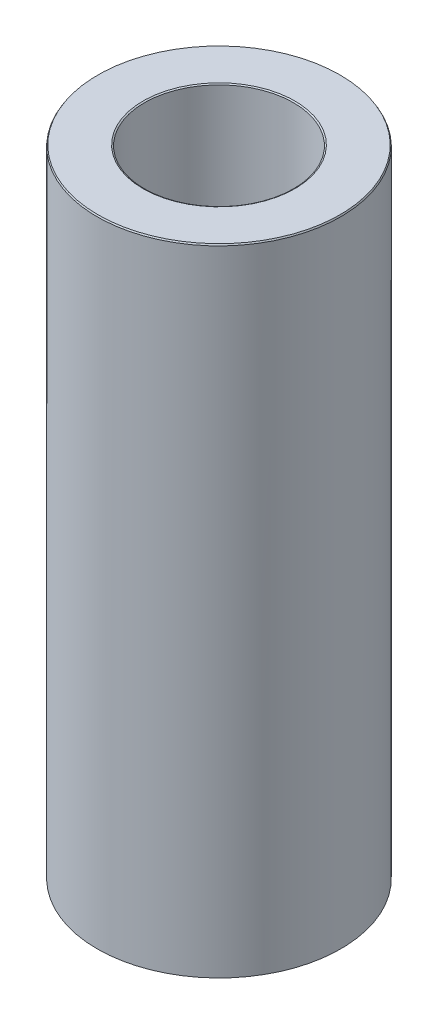
ISO-10303-21;
HEADER;
FILE_DESCRIPTION(('STEP AP214'),'2;1');
FILE_NAME('part.step','',(''),(''),'','','');
FILE_SCHEMA(('AUTOMOTIVE_DESIGN { 1 0 10303 214 1 1 1 1 }'));
ENDSEC;
DATA;
#1=APPLICATION_CONTEXT('core data for automotive mechanical design processes');
#2=APPLICATION_PROTOCOL_DEFINITION('international standard','automotive_design',2000,#1);
#3=PRODUCT_CONTEXT('',#1,'mechanical');
#4=PRODUCT('Part','Part','',(#3));
#5=PRODUCT_RELATED_PRODUCT_CATEGORY('part','',(#4));
#6=PRODUCT_DEFINITION_FORMATION('','',#4);
#7=PRODUCT_DEFINITION_CONTEXT('part definition',#1,'design');
#8=PRODUCT_DEFINITION('design','',#6,#7);
#9=PRODUCT_DEFINITION_SHAPE('','',#8);
#10=(LENGTH_UNIT() NAMED_UNIT(*) SI_UNIT(.MILLI.,.METRE.));
#11=(NAMED_UNIT(*) PLANE_ANGLE_UNIT() SI_UNIT($,.RADIAN.));
#12=(NAMED_UNIT(*) SI_UNIT($,.STERADIAN.) SOLID_ANGLE_UNIT());
#13=UNCERTAINTY_MEASURE_WITH_UNIT(LENGTH_MEASURE(1.E-05),#10,'distance_accuracy_value','');
#14=(GEOMETRIC_REPRESENTATION_CONTEXT(3) GLOBAL_UNCERTAINTY_ASSIGNED_CONTEXT((#13)) GLOBAL_UNIT_ASSIGNED_CONTEXT((#10,
#11,#12)) REPRESENTATION_CONTEXT('',''));
#15=CARTESIAN_POINT('',(0.,0.,0.));
#16=DIRECTION('',(0.,0.,1.));
#17=DIRECTION('',(1.,0.,0.));
#18=AXIS2_PLACEMENT_3D('',#15,#16,#17);
#19=CARTESIAN_POINT('',(0.,300.156189150975,0.));
#20=DIRECTION('',(0.,-1.,0.));
#21=DIRECTION('',(0.,0.,-1.));
#22=AXIS2_PLACEMENT_3D('',#19,#20,#21);
#23=CYLINDRICAL_SURFACE('',#22,57.5);
#24=CARTESIAN_POINT('',(0.,0.37526282528616,0.));
#25=DIRECTION('',(0.,1.,0.));
#26=DIRECTION('',(0.,0.,1.));
#27=AXIS2_PLACEMENT_3D('',#24,#25,#26);
#28=CIRCLE('',#27,57.5);
#29=CARTESIAN_POINT('',(0.,0.375262825286105,-57.5));
#30=VERTEX_POINT('',#29);
#31=EDGE_CURVE('E10',#30,#30,#28,.T.);
#32=CARTESIAN_POINT('',(0.,299.506214871388,0.));
#33=DIRECTION('',(0.,1.,0.));
#34=DIRECTION('',(0.,0.,1.));
#35=AXIS2_PLACEMENT_3D('',#32,#33,#34);
#36=CIRCLE('',#35,57.5);
#37=CARTESIAN_POINT('',(0.,299.506214871388,-57.5));
#38=VERTEX_POINT('',#37);
#39=EDGE_CURVE('E50',#38,#38,#36,.F.);
#40=CARTESIAN_POINT('',(0.,0.375262825286105,-57.5));
#41=CARTESIAN_POINT('',(0.,3.491210242433,-57.5));
#42=CARTESIAN_POINT('',(0.,6.6071576595799,-57.5));
#43=CARTESIAN_POINT('',(0.,12.8390524938737,-57.5));
#44=CARTESIAN_POINT('',(0.,15.9549999110206,-57.5));
#45=CARTESIAN_POINT('',(0.,22.1868947453144,-57.5));
#46=CARTESIAN_POINT('',(0.,25.3028421624613,-57.5));
#47=CARTESIAN_POINT('',(0.,31.5347369967551,-57.5));
#48=CARTESIAN_POINT('',(0.,34.650684413902,-57.5));
#49=CARTESIAN_POINT('',(0.,40.8825792481958,-57.5));
#50=CARTESIAN_POINT('',(0.,43.9985266653427,-57.5));
#51=CARTESIAN_POINT('',(0.,50.2304214996365,-57.5));
#52=CARTESIAN_POINT('',(0.,53.3463689167833,-57.5));
#53=CARTESIAN_POINT('',(0.,59.5782637510771,-57.5));
#54=CARTESIAN_POINT('',(0.,62.694211168224,-57.5));
#55=CARTESIAN_POINT('',(0.,68.9261060025178,-57.5));
#56=CARTESIAN_POINT('',(0.,72.0420534196647,-57.5));
#57=CARTESIAN_POINT('',(0.,78.2739482539585,-57.5));
#58=CARTESIAN_POINT('',(0.,81.3898956711054,-57.5));
#59=CARTESIAN_POINT('',(0.,87.6217905053992,-57.5));
#60=CARTESIAN_POINT('',(0.,90.7377379225461,-57.5));
#61=CARTESIAN_POINT('',(0.,96.9696327568399,-57.5));
#62=CARTESIAN_POINT('',(0.,100.085580173987,-57.5));
#63=CARTESIAN_POINT('',(0.,106.317475008281,-57.5));
#64=CARTESIAN_POINT('',(0.,109.433422425427,-57.5));
#65=CARTESIAN_POINT('',(0.,115.665317259721,-57.5));
#66=CARTESIAN_POINT('',(0.,118.781264676868,-57.5));
#67=CARTESIAN_POINT('',(0.,125.013159511162,-57.5));
#68=CARTESIAN_POINT('',(0.,128.129106928309,-57.5));
#69=CARTESIAN_POINT('',(0.,134.361001762603,-57.5));
#70=CARTESIAN_POINT('',(0.,137.47694917975,-57.5));
#71=CARTESIAN_POINT('',(0.,143.708844014043,-57.5));
#72=CARTESIAN_POINT('',(0.,146.82479143119,-57.5));
#73=CARTESIAN_POINT('',(0.,153.056686265484,-57.5));
#74=CARTESIAN_POINT('',(0.,156.172633682631,-57.5));
#75=CARTESIAN_POINT('',(0.,162.404528516925,-57.5));
#76=CARTESIAN_POINT('',(0.,165.520475934072,-57.5));
#77=CARTESIAN_POINT('',(0.,171.752370768365,-57.5));
#78=CARTESIAN_POINT('',(0.,174.868318185512,-57.5));
#79=CARTESIAN_POINT('',(0.,181.100213019806,-57.5));
#80=CARTESIAN_POINT('',(0.,184.216160436953,-57.5));
#81=CARTESIAN_POINT('',(0.,190.448055271247,-57.5));
#82=CARTESIAN_POINT('',(0.,193.564002688394,-57.5));
#83=CARTESIAN_POINT('',(0.,199.795897522688,-57.5));
#84=CARTESIAN_POINT('',(0.,202.911844939834,-57.5));
#85=CARTESIAN_POINT('',(0.,209.143739774128,-57.5));
#86=CARTESIAN_POINT('',(0.,212.259687191275,-57.5));
#87=CARTESIAN_POINT('',(0.,218.491582025569,-57.5));
#88=CARTESIAN_POINT('',(0.,221.607529442716,-57.5));
#89=CARTESIAN_POINT('',(0.,227.83942427701,-57.5));
#90=CARTESIAN_POINT('',(0.,230.955371694156,-57.5));
#91=CARTESIAN_POINT('',(0.,237.18726652845,-57.5));
#92=CARTESIAN_POINT('',(0.,240.303213945597,-57.5));
#93=CARTESIAN_POINT('',(0.,246.535108779891,-57.5));
#94=CARTESIAN_POINT('',(0.,249.651056197038,-57.5));
#95=CARTESIAN_POINT('',(0.,255.882951031332,-57.5));
#96=CARTESIAN_POINT('',(0.,258.998898448479,-57.5));
#97=CARTESIAN_POINT('',(0.,265.230793282772,-57.5));
#98=CARTESIAN_POINT('',(0.,268.346740699919,-57.5));
#99=CARTESIAN_POINT('',(0.,274.578635534213,-57.5));
#100=CARTESIAN_POINT('',(0.,277.69458295136,-57.5));
#101=CARTESIAN_POINT('',(0.,283.926477785654,-57.5));
#102=CARTESIAN_POINT('',(0.,287.042425202801,-57.5));
#103=CARTESIAN_POINT('',(0.,293.274320037094,-57.5));
#104=CARTESIAN_POINT('',(0.,296.390267454241,-57.5));
#105=CARTESIAN_POINT('',(0.,299.506214871388,-57.5));
#106=B_SPLINE_CURVE_WITH_KNOTS('',3,(#40,#41,#42,#43,#44,#45,#46,#47,#48,#49,#50,#51,#52,#53,
#54,#55,#56,#57,#58,#59,#60,#61,#62,#63,#64,#65,#66,#67,#68,#69,#70,#71,#72,#73,#74,#75,#76,#77,
#78,#79,#80,#81,#82,#83,#84,#85,#86,#87,#88,#89,#90,#91,#92,#93,#94,#95,#96,#97,#98,#99,#100,
#101,#102,#103,#104,#105),.UNSPECIFIED.,.F.,.F.,(4,2,2,2,2,2,2,2,2,2,2,2,2,2,2,2,2,2,2,2,2,2,2,
2,2,2,2,2,2,2,2,2,4),(0.,9.3478422514407,18.6956845028814,28.0435267543221,37.3913690057628,
46.7392112572035,56.0870535086441,65.4348957600848,74.7827380115255,84.1305802629662,
93.4784225144069,102.826264765848,112.174107017288,121.521949268729,130.86979152017,
140.21763377161,149.565476023051,158.913318274492,168.261160525932,177.609002777373,
186.956845028814,196.304687280255,205.652529531695,215.000371783136,224.348214034577,
233.696056286017,243.043898537458,252.391740788899,261.739583040339,271.08742529178,
280.435267543221,289.783109794661,299.130952046102),.UNSPECIFIED.);
#107=EDGE_CURVE('BSEAM39',#30,#38,#106,.T.);
#108=ORIENTED_EDGE('',*,*,#31,.T.);
#109=ORIENTED_EDGE('',*,*,#39,.T.);
#110=ORIENTED_EDGE('',*,*,#107,.T.);
#111=ORIENTED_EDGE('',*,*,#107,.F.);
#112=EDGE_LOOP('',(#108,#110,#109,#111));
#113=FACE_BOUND('',#112,.T.);
#114=ADVANCED_FACE('F39',(#113),#23,.T.);
#115=CARTESIAN_POINT('',(0.,300.156189150975,0.));
#116=DIRECTION('',(0.,1.,0.));
#117=DIRECTION('',(0.,0.,1.));
#118=AXIS2_PLACEMENT_3D('',#115,#116,#117);
#119=PLANE('',#118);
#120=CARTESIAN_POINT('',(0.,300.156189150975,0.));
#121=DIRECTION('',(0.,1.,0.));
#122=DIRECTION('',(0.,0.,1.));
#123=AXIS2_PLACEMENT_3D('',#120,#121,#122);
#124=CIRCLE('',#123,35.8382287100458);
#125=CARTESIAN_POINT('',(0.,300.156189150975,35.8382287100458));
#126=VERTEX_POINT('',#125);
#127=EDGE_CURVE('E58',#126,#126,#124,.F.);
#128=ORIENTED_EDGE('',*,*,#127,.T.);
#129=EDGE_LOOP('',(#128));
#130=FACE_BOUND('',#129,.T.);
#131=CARTESIAN_POINT('',(0.,300.156189150975,0.));
#132=DIRECTION('',(0.,1.,0.));
#133=DIRECTION('',(0.,0.,1.));
#134=AXIS2_PLACEMENT_3D('',#131,#132,#133);
#135=CIRCLE('',#134,57.1247371747141);
#136=CARTESIAN_POINT('',(0.,300.156189150975,57.1247371747141));
#137=VERTEX_POINT('',#136);
#138=EDGE_CURVE('E61',#137,#137,#135,.T.);
#139=ORIENTED_EDGE('',*,*,#138,.T.);
#140=EDGE_LOOP('',(#139));
#141=FACE_BOUND('',#140,.T.);
#142=ADVANCED_FACE('F88',(#130,#141),#119,.T.);
#143=CARTESIAN_POINT('',(0.,0.,0.));
#144=DIRECTION('',(0.,1.,0.));
#145=DIRECTION('',(0.,0.,1.));
#146=AXIS2_PLACEMENT_3D('',#143,#144,#145);
#147=PLANE('',#146);
#148=CARTESIAN_POINT('',(0.,0.,0.));
#149=DIRECTION('',(0.,1.,0.));
#150=DIRECTION('',(0.,0.,1.));
#151=AXIS2_PLACEMENT_3D('',#148,#149,#150);
#152=CIRCLE('',#151,35.5635172557445);
#153=CARTESIAN_POINT('',(0.,0.,35.5635172557445));
#154=VERTEX_POINT('',#153);
#155=EDGE_CURVE('E51',#154,#154,#152,.T.);
#156=ORIENTED_EDGE('',*,*,#155,.T.);
#157=EDGE_LOOP('',(#156));
#158=FACE_BOUND('',#157,.T.);
#159=CARTESIAN_POINT('',(0.,0.,0.));
#160=DIRECTION('',(0.,1.,0.));
#161=DIRECTION('',(0.,0.,1.));
#162=AXIS2_PLACEMENT_3D('',#159,#160,#161);
#163=CIRCLE('',#162,56.8500257204125);
#164=CARTESIAN_POINT('',(0.,0.,56.8500257204125));
#165=VERTEX_POINT('',#164);
#166=EDGE_CURVE('E54',#165,#165,#163,.F.);
#167=ORIENTED_EDGE('',*,*,#166,.T.);
#168=EDGE_LOOP('',(#167));
#169=FACE_BOUND('',#168,.T.);
#170=ADVANCED_FACE('F83',(#158,#169),#147,.F.);
#171=CARTESIAN_POINT('',(0.,300.156189150975,0.));
#172=DIRECTION('',(0.,-1.,0.));
#173=DIRECTION('',(0.,0.,-1.));
#174=AXIS2_PLACEMENT_3D('',#171,#172,#173);
#175=CYLINDRICAL_SURFACE('',#174,35.1882544304584);
#176=CARTESIAN_POINT('',(0.,299.780926325689,0.));
#177=DIRECTION('',(0.,1.,0.));
#178=DIRECTION('',(0.,0.,1.));
#179=AXIS2_PLACEMENT_3D('',#176,#177,#178);
#180=CIRCLE('',#179,35.1882544304584);
#181=CARTESIAN_POINT('',(0.,299.780926325689,-35.1882544304584));
#182=VERTEX_POINT('',#181);
#183=EDGE_CURVE('E67',#182,#182,#180,.T.);
#184=CARTESIAN_POINT('',(0.,0.649974279587295,0.));
#185=DIRECTION('',(0.,1.,0.));
#186=DIRECTION('',(0.,0.,1.));
#187=AXIS2_PLACEMENT_3D('',#184,#185,#186);
#188=CIRCLE('',#187,35.1882544304584);
#189=CARTESIAN_POINT('',(0.,0.64997427958724,-35.1882544304584));
#190=VERTEX_POINT('',#189);
#191=EDGE_CURVE('E69',#190,#190,#188,.F.);
#192=CARTESIAN_POINT('',(0.,299.780926325689,-35.1882544304584));
#193=CARTESIAN_POINT('',(0.,296.664978908542,-35.1882544304584));
#194=CARTESIAN_POINT('',(0.,293.549031491395,-35.1882544304584));
#195=CARTESIAN_POINT('',(0.,287.317136657102,-35.1882544304584));
#196=CARTESIAN_POINT('',(0.,284.201189239955,-35.1882544304584));
#197=CARTESIAN_POINT('',(0.,277.969294405661,-35.1882544304584));
#198=CARTESIAN_POINT('',(0.,274.853346988514,-35.1882544304584));
#199=CARTESIAN_POINT('',(0.,268.62145215422,-35.1882544304584));
#200=CARTESIAN_POINT('',(0.,265.505504737073,-35.1882544304584));
#201=CARTESIAN_POINT('',(0.,259.27360990278,-35.1882544304584));
#202=CARTESIAN_POINT('',(0.,256.157662485633,-35.1882544304584));
#203=CARTESIAN_POINT('',(0.,249.925767651339,-35.1882544304584));
#204=CARTESIAN_POINT('',(0.,246.809820234192,-35.1882544304584));
#205=CARTESIAN_POINT('',(0.,240.577925399898,-35.1882544304584));
#206=CARTESIAN_POINT('',(0.,237.461977982751,-35.1882544304584));
#207=CARTESIAN_POINT('',(0.,231.230083148457,-35.1882544304584));
#208=CARTESIAN_POINT('',(0.,228.114135731311,-35.1882544304584));
#209=CARTESIAN_POINT('',(0.,221.882240897017,-35.1882544304584));
#210=CARTESIAN_POINT('',(0.,218.76629347987,-35.1882544304584));
#211=CARTESIAN_POINT('',(0.,212.534398645576,-35.1882544304584));
#212=CARTESIAN_POINT('',(0.,209.418451228429,-35.1882544304584));
#213=CARTESIAN_POINT('',(0.,203.186556394135,-35.1882544304584));
#214=CARTESIAN_POINT('',(0.,200.070608976989,-35.1882544304584));
#215=CARTESIAN_POINT('',(0.,193.838714142695,-35.1882544304584));
#216=CARTESIAN_POINT('',(0.,190.722766725548,-35.1882544304584));
#217=CARTESIAN_POINT('',(0.,184.490871891254,-35.1882544304584));
#218=CARTESIAN_POINT('',(0.,181.374924474107,-35.1882544304584));
#219=CARTESIAN_POINT('',(0.,175.143029639813,-35.1882544304584));
#220=CARTESIAN_POINT('',(0.,172.027082222666,-35.1882544304584));
#221=CARTESIAN_POINT('',(0.,165.795187388373,-35.1882544304584));
#222=CARTESIAN_POINT('',(0.,162.679239971226,-35.1882544304584));
#223=CARTESIAN_POINT('',(0.,156.447345136932,-35.1882544304584));
#224=CARTESIAN_POINT('',(0.,153.331397719785,-35.1882544304584));
#225=CARTESIAN_POINT('',(0.,147.099502885491,-35.1882544304584));
#226=CARTESIAN_POINT('',(0.,143.983555468344,-35.1882544304584));
#227=CARTESIAN_POINT('',(0.,137.751660634051,-35.1882544304584));
#228=CARTESIAN_POINT('',(0.,134.635713216904,-35.1882544304584));
#229=CARTESIAN_POINT('',(0.,128.40381838261,-35.1882544304584));
#230=CARTESIAN_POINT('',(0.,125.287870965463,-35.1882544304584));
#231=CARTESIAN_POINT('',(0.,119.055976131169,-35.1882544304584));
#232=CARTESIAN_POINT('',(0.,115.940028714022,-35.1882544304584));
#233=CARTESIAN_POINT('',(0.,109.708133879729,-35.1882544304584));
#234=CARTESIAN_POINT('',(0.,106.592186462582,-35.1882544304584));
#235=CARTESIAN_POINT('',(0.,100.360291628288,-35.1882544304584));
#236=CARTESIAN_POINT('',(0.,97.244344211141,-35.1882544304584));
#237=CARTESIAN_POINT('',(0.,91.0124493768472,-35.1882544304584));
#238=CARTESIAN_POINT('',(0.,87.8965019597003,-35.1882544304584));
#239=CARTESIAN_POINT('',(0.,81.6646071254065,-35.1882544304584));
#240=CARTESIAN_POINT('',(0.,78.5486597082596,-35.1882544304584));
#241=CARTESIAN_POINT('',(0.,72.3167648739658,-35.1882544304584));
#242=CARTESIAN_POINT('',(0.,69.2008174568189,-35.1882544304584));
#243=CARTESIAN_POINT('',(0.,62.9689226225251,-35.1882544304584));
#244=CARTESIAN_POINT('',(0.,59.8529752053783,-35.1882544304584));
#245=CARTESIAN_POINT('',(0.,53.6210803710845,-35.1882544304584));
#246=CARTESIAN_POINT('',(0.,50.5051329539376,-35.1882544304584));
#247=CARTESIAN_POINT('',(0.,44.2732381196438,-35.1882544304584));
#248=CARTESIAN_POINT('',(0.,41.1572907024969,-35.1882544304584));
#249=CARTESIAN_POINT('',(0.,34.9253958682031,-35.1882544304584));
#250=CARTESIAN_POINT('',(0.,31.8094484510562,-35.1882544304584));
#251=CARTESIAN_POINT('',(0.,25.5775536167624,-35.1882544304584));
#252=CARTESIAN_POINT('',(0.,22.4616061996155,-35.1882544304584));
#253=CARTESIAN_POINT('',(0.,16.2297113653217,-35.1882544304584));
#254=CARTESIAN_POINT('',(0.,13.1137639481748,-35.1882544304584));
#255=CARTESIAN_POINT('',(0.,6.88186911388104,-35.1882544304584));
#256=CARTESIAN_POINT('',(0.,3.76592169673414,-35.1882544304584));
#257=CARTESIAN_POINT('',(0.,0.64997427958724,-35.1882544304584));
#258=B_SPLINE_CURVE_WITH_KNOTS('',3,(#192,#193,#194,#195,#196,#197,#198,#199,#200,#201,#202,
#203,#204,#205,#206,#207,#208,#209,#210,#211,#212,#213,#214,#215,#216,#217,#218,#219,#220,#221,
#222,#223,#224,#225,#226,#227,#228,#229,#230,#231,#232,#233,#234,#235,#236,#237,#238,#239,#240,
#241,#242,#243,#244,#245,#246,#247,#248,#249,#250,#251,#252,#253,#254,#255,#256,#257),
.UNSPECIFIED.,.F.,.F.,(4,2,2,2,2,2,2,2,2,2,2,2,2,2,2,2,2,2,2,2,2,2,2,2,2,2,2,2,2,2,2,2,4),(0.,
9.34784225144064,18.6956845028813,28.043526754322,37.3913690057627,46.7392112572034,
56.0870535086441,65.4348957600848,74.7827380115255,84.1305802629661,93.4784225144068,
102.826264765847,112.174107017288,121.521949268729,130.86979152017,140.21763377161,
149.565476023051,158.913318274492,168.261160525932,177.609002777373,186.956845028814,
196.304687280254,205.652529531695,215.000371783136,224.348214034576,233.696056286017,
243.043898537458,252.391740788898,261.739583040339,271.08742529178,280.435267543221,
289.783109794661,299.130952046102),.UNSPECIFIED.);
#259=EDGE_CURVE('BSEAM71',#182,#190,#258,.T.);
#260=ORIENTED_EDGE('',*,*,#183,.T.);
#261=ORIENTED_EDGE('',*,*,#191,.T.);
#262=ORIENTED_EDGE('',*,*,#259,.T.);
#263=ORIENTED_EDGE('',*,*,#259,.F.);
#264=EDGE_LOOP('',(#260,#262,#261,#263));
#265=FACE_BOUND('',#264,.T.);
#266=ADVANCED_FACE('F71',(#265),#175,.F.);
#267=CARTESIAN_POINT('',(0.,299.780926325689,0.));
#268=DIRECTION('',(0.,1.,0.));
#269=DIRECTION('',(0.,0.,1.));
#270=AXIS2_PLACEMENT_3D('',#267,#268,#269);
#271=CONICAL_SURFACE('',#270,35.1882544304584,1.04719755119655);
#272=ORIENTED_EDGE('',*,*,#127,.F.);
#273=EDGE_LOOP('',(#272));
#274=FACE_BOUND('',#273,.T.);
#275=ORIENTED_EDGE('',*,*,#183,.F.);
#276=EDGE_LOOP('',(#275));
#277=FACE_BOUND('',#276,.T.);
#278=ADVANCED_FACE('F77',(#274,#277),#271,.F.);
#279=CARTESIAN_POINT('',(0.,0.,0.));
#280=DIRECTION('',(0.,-1.,0.));
#281=DIRECTION('',(0.,0.,-1.));
#282=AXIS2_PLACEMENT_3D('',#279,#280,#281);
#283=CONICAL_SURFACE('',#282,35.5635172557445,0.523598775598296);
#284=ORIENTED_EDGE('',*,*,#191,.F.);
#285=EDGE_LOOP('',(#284));
#286=FACE_BOUND('',#285,.T.);
#287=ORIENTED_EDGE('',*,*,#155,.F.);
#288=EDGE_LOOP('',(#287));
#289=FACE_BOUND('',#288,.T.);
#290=ADVANCED_FACE('F73',(#286,#289),#283,.F.);
#291=CARTESIAN_POINT('',(0.,0.37526282528616,0.));
#292=DIRECTION('',(0.,1.,0.));
#293=DIRECTION('',(0.,0.,1.));
#294=AXIS2_PLACEMENT_3D('',#291,#292,#293);
#295=CONICAL_SURFACE('',#294,57.5,1.0471975511966);
#296=ORIENTED_EDGE('',*,*,#166,.F.);
#297=EDGE_LOOP('',(#296));
#298=FACE_BOUND('',#297,.T.);
#299=ORIENTED_EDGE('',*,*,#31,.F.);
#300=EDGE_LOOP('',(#299));
#301=FACE_BOUND('',#300,.T.);
#302=ADVANCED_FACE('F76',(#298,#301),#295,.T.);
#303=CARTESIAN_POINT('',(0.,300.156189150975,0.));
#304=DIRECTION('',(0.,-1.,0.));
#305=DIRECTION('',(0.,0.,-1.));
#306=AXIS2_PLACEMENT_3D('',#303,#304,#305);
#307=CONICAL_SURFACE('',#306,57.1247371747141,0.523598775598292);
#308=ORIENTED_EDGE('',*,*,#39,.F.);
#309=EDGE_LOOP('',(#308));
#310=FACE_BOUND('',#309,.T.);
#311=ORIENTED_EDGE('',*,*,#138,.F.);
#312=EDGE_LOOP('',(#311));
#313=FACE_BOUND('',#312,.T.);
#314=ADVANCED_FACE('F45',(#310,#313),#307,.T.);
#315=CLOSED_SHELL('',(#114,#142,#170,#266,#278,#290,#302,#314));
#316=MANIFOLD_SOLID_BREP('B2',#315);
#317=ADVANCED_BREP_SHAPE_REPRESENTATION('',(#18,#316),#14);
#318=SHAPE_DEFINITION_REPRESENTATION(#9,#317);
ENDSEC;
END-ISO-10303-21;
